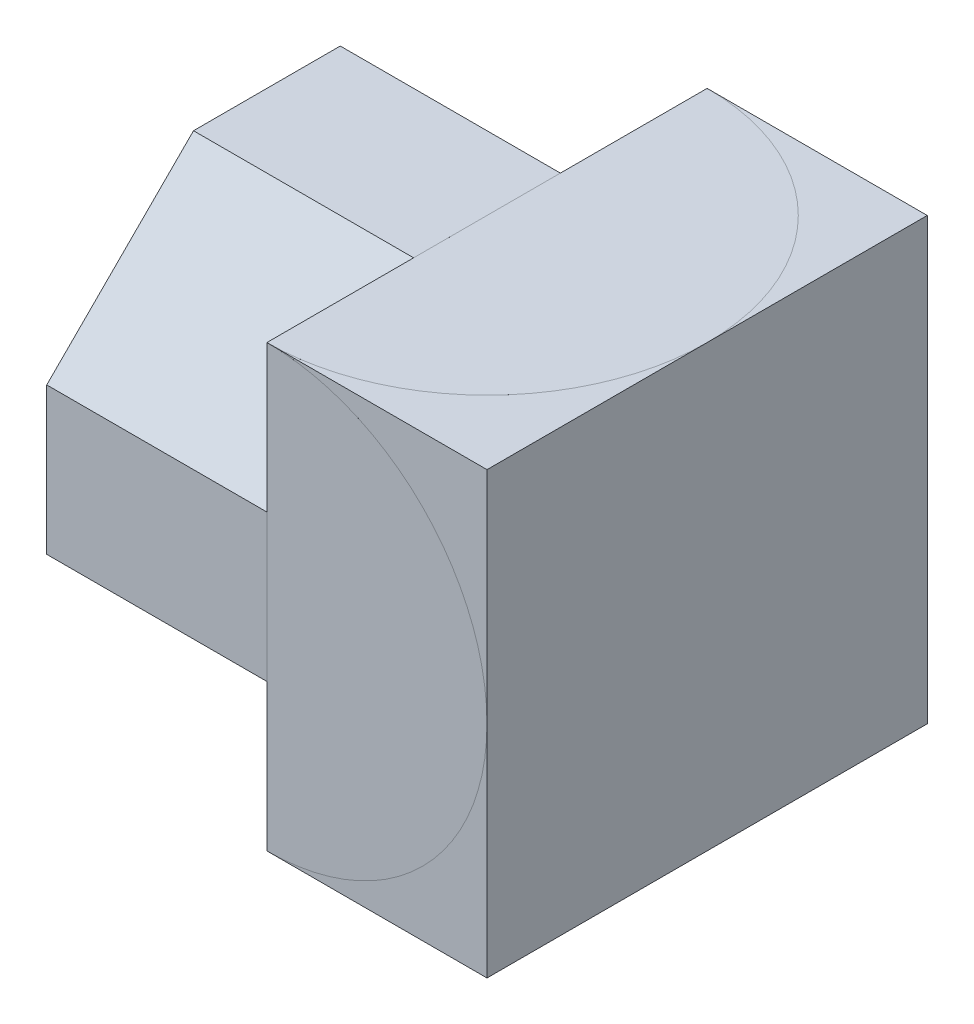
ISO-10303-21;
HEADER;
FILE_DESCRIPTION(('STEP AP214'),'2;1');
FILE_NAME('part.step','',(''),(''),'','','');
FILE_SCHEMA(('AUTOMOTIVE_DESIGN { 1 0 10303 214 1 1 1 1 }'));
ENDSEC;
DATA;
#1=APPLICATION_CONTEXT('core data for automotive mechanical design processes');
#2=APPLICATION_PROTOCOL_DEFINITION('international standard','automotive_design',2000,#1);
#3=PRODUCT_CONTEXT('',#1,'mechanical');
#4=PRODUCT('Part','Part','',(#3));
#5=PRODUCT_RELATED_PRODUCT_CATEGORY('part','',(#4));
#6=PRODUCT_DEFINITION_FORMATION('','',#4);
#7=PRODUCT_DEFINITION_CONTEXT('part definition',#1,'design');
#8=PRODUCT_DEFINITION('design','',#6,#7);
#9=PRODUCT_DEFINITION_SHAPE('','',#8);
#10=(LENGTH_UNIT() NAMED_UNIT(*) SI_UNIT(.MILLI.,.METRE.));
#11=(NAMED_UNIT(*) PLANE_ANGLE_UNIT() SI_UNIT($,.RADIAN.));
#12=(NAMED_UNIT(*) SI_UNIT($,.STERADIAN.) SOLID_ANGLE_UNIT());
#13=UNCERTAINTY_MEASURE_WITH_UNIT(LENGTH_MEASURE(1.E-05),#10,'distance_accuracy_value','');
#14=(GEOMETRIC_REPRESENTATION_CONTEXT(3) GLOBAL_UNCERTAINTY_ASSIGNED_CONTEXT((#13)) GLOBAL_UNIT_ASSIGNED_CONTEXT((#10,
#11,#12)) REPRESENTATION_CONTEXT('',''));
#15=CARTESIAN_POINT('',(0.,0.,0.));
#16=DIRECTION('',(0.,0.,1.));
#17=DIRECTION('',(1.,0.,0.));
#18=AXIS2_PLACEMENT_3D('',#15,#16,#17);
#19=CARTESIAN_POINT('',(0.,0.,60.));
#20=DIRECTION('',(0.,0.,-1.));
#21=DIRECTION('',(-1.,0.,0.));
#22=AXIS2_PLACEMENT_3D('',#19,#20,#21);
#23=PLANE('',#22);
#24=DIRECTION('',(-1.,0.,0.));
#25=VECTOR('',#24,1.);
#26=CARTESIAN_POINT('',(0.,60.,60.));
#27=LINE('',#26,#25);
#28=CARTESIAN_POINT('',(60.,60.,60.));
#29=VERTEX_POINT('',#28);
#30=CARTESIAN_POINT('',(30.,60.,60.));
#31=VERTEX_POINT('',#30);
#32=EDGE_CURVE('E237',#29,#31,#27,.T.);
#33=ORIENTED_EDGE('',*,*,#32,.T.);
#34=CARTESIAN_POINT('',(30.,30.,60.));
#35=DIRECTION('',(0.,0.,1.));
#36=DIRECTION('',(-1.,0.,0.));
#37=AXIS2_PLACEMENT_3D('',#34,#35,#36);
#38=CIRCLE('',#37,30.);
#39=CARTESIAN_POINT('',(60.,30.,59.99995));
#40=VERTEX_POINT('',#39);
#41=EDGE_CURVE('E253',#40,#31,#38,.T.);
#42=ORIENTED_EDGE('',*,*,#41,.F.);
#43=DIRECTION('',(0.,1.,0.));
#44=VECTOR('',#43,1.);
#45=CARTESIAN_POINT('',(60.,0.,60.));
#46=LINE('',#45,#44);
#47=EDGE_CURVE('E37',#40,#29,#46,.T.);
#48=ORIENTED_EDGE('',*,*,#47,.T.);
#49=EDGE_LOOP('',(#33,#42,#48));
#50=FACE_BOUND('',#49,.T.);
#51=ADVANCED_FACE('F33',(#50),#23,.F.);
#52=CARTESIAN_POINT('',(60.,0.,60.));
#53=VERTEX_POINT('',#52);
#54=EDGE_CURVE('E240',#53,#40,#46,.T.);
#55=ORIENTED_EDGE('',*,*,#54,.T.);
#56=CARTESIAN_POINT('',(30.,0.,60.));
#57=VERTEX_POINT('',#56);
#58=EDGE_CURVE('E173',#57,#40,#38,.T.);
#59=ORIENTED_EDGE('',*,*,#58,.F.);
#60=DIRECTION('',(1.,0.,0.));
#61=VECTOR('',#60,1.);
#62=CARTESIAN_POINT('',(0.,0.,60.));
#63=LINE('',#62,#61);
#64=EDGE_CURVE('E183',#57,#53,#63,.T.);
#65=ORIENTED_EDGE('',*,*,#64,.T.);
#66=EDGE_LOOP('',(#55,#59,#65));
#67=FACE_BOUND('',#66,.T.);
#68=ADVANCED_FACE('F360',(#67),#23,.F.);
#69=CARTESIAN_POINT('',(0.,60.,60.));
#70=DIRECTION('',(0.,-1.,0.));
#71=DIRECTION('',(0.,0.,-1.));
#72=AXIS2_PLACEMENT_3D('',#69,#70,#71);
#73=PLANE('',#72);
#74=DIRECTION('',(-1.,0.,0.));
#75=VECTOR('',#74,1.);
#76=CARTESIAN_POINT('',(0.,60.,0.));
#77=LINE('',#76,#75);
#78=CARTESIAN_POINT('',(60.,60.,0.));
#79=VERTEX_POINT('',#78);
#80=CARTESIAN_POINT('',(30.,60.,0.));
#81=VERTEX_POINT('',#80);
#82=EDGE_CURVE('E234',#79,#81,#77,.T.);
#83=ORIENTED_EDGE('',*,*,#82,.T.);
#84=CARTESIAN_POINT('',(30.,60.,30.));
#85=DIRECTION('',(0.,1.,0.));
#86=DIRECTION('',(0.,0.,-1.));
#87=AXIS2_PLACEMENT_3D('',#84,#85,#86);
#88=CIRCLE('',#87,30.);
#89=CARTESIAN_POINT('',(60.,59.99995,30.));
#90=VERTEX_POINT('',#89);
#91=EDGE_CURVE('E267',#90,#81,#88,.T.);
#92=ORIENTED_EDGE('',*,*,#91,.F.);
#93=DIRECTION('',(0.,0.,-1.));
#94=VECTOR('',#93,1.);
#95=CARTESIAN_POINT('',(60.,60.,60.));
#96=LINE('',#95,#94);
#97=EDGE_CURVE('E247',#90,#79,#96,.T.);
#98=ORIENTED_EDGE('',*,*,#97,.T.);
#99=EDGE_LOOP('',(#83,#92,#98));
#100=FACE_BOUND('',#99,.T.);
#101=ADVANCED_FACE('F306',(#100),#73,.F.);
#102=EDGE_CURVE('E322',#29,#90,#96,.T.);
#103=ORIENTED_EDGE('',*,*,#102,.T.);
#104=EDGE_CURVE('E264',#31,#90,#88,.T.);
#105=ORIENTED_EDGE('',*,*,#104,.F.);
#106=ORIENTED_EDGE('',*,*,#32,.F.);
#107=EDGE_LOOP('',(#103,#105,#106));
#108=FACE_BOUND('',#107,.T.);
#109=ADVANCED_FACE('F375',(#108),#73,.F.);
#110=CARTESIAN_POINT('',(0.,0.,60.));
#111=DIRECTION('',(1.,0.,0.));
#112=DIRECTION('',(0.,0.,-1.));
#113=AXIS2_PLACEMENT_3D('',#110,#111,#112);
#114=PLANE('',#113);
#115=DIRECTION('',(0.,-1.,0.));
#116=VECTOR('',#115,1.);
#117=CARTESIAN_POINT('',(0.,0.,0.));
#118=LINE('',#117,#116);
#119=CARTESIAN_POINT('',(0.,40.,0.));
#120=VERTEX_POINT('',#119);
#121=CARTESIAN_POINT('',(0.,20.,0.));
#122=VERTEX_POINT('',#121);
#123=EDGE_CURVE('E230',#120,#122,#118,.T.);
#124=ORIENTED_EDGE('',*,*,#123,.T.);
#125=DIRECTION('',(0.,0.707106781186547,-0.707106781186548));
#126=VECTOR('',#125,1.);
#127=CARTESIAN_POINT('',(0.,20.,0.));
#128=LINE('',#127,#126);
#129=CARTESIAN_POINT('',(0.,0.,20.));
#130=VERTEX_POINT('',#129);
#131=EDGE_CURVE('E279',#130,#122,#128,.T.);
#132=ORIENTED_EDGE('',*,*,#131,.F.);
#133=DIRECTION('',(0.,0.,-1.));
#134=VECTOR('',#133,1.);
#135=CARTESIAN_POINT('',(0.,0.,60.));
#136=LINE('',#135,#134);
#137=CARTESIAN_POINT('',(0.,0.,40.0000000000004));
#138=VERTEX_POINT('',#137);
#139=EDGE_CURVE('E43',#138,#130,#136,.T.);
#140=ORIENTED_EDGE('',*,*,#139,.F.);
#141=DIRECTION('',(0.,-0.707106781186554,-0.707106781186541));
#142=VECTOR('',#141,1.);
#143=CARTESIAN_POINT('',(0.,20.,60.));
#144=LINE('',#143,#142);
#145=CARTESIAN_POINT('',(0.,20.,60.));
#146=VERTEX_POINT('',#145);
#147=EDGE_CURVE('E197',#146,#138,#144,.T.);
#148=ORIENTED_EDGE('',*,*,#147,.F.);
#149=DIRECTION('',(0.,-1.,0.));
#150=VECTOR('',#149,1.);
#151=CARTESIAN_POINT('',(0.,0.,60.));
#152=LINE('',#151,#150);
#153=CARTESIAN_POINT('',(0.,40.,60.));
#154=VERTEX_POINT('',#153);
#155=EDGE_CURVE('E231',#154,#146,#152,.T.);
#156=ORIENTED_EDGE('',*,*,#155,.F.);
#157=DIRECTION('',(0.,0.707106781186548,-0.707106781186547));
#158=VECTOR('',#157,1.);
#159=CARTESIAN_POINT('',(0.,40.,60.));
#160=LINE('',#159,#158);
#161=CARTESIAN_POINT('',(0.,60.,40.));
#162=VERTEX_POINT('',#161);
#163=EDGE_CURVE('E205',#154,#162,#160,.T.);
#164=ORIENTED_EDGE('',*,*,#163,.T.);
#165=DIRECTION('',(0.,0.,-1.));
#166=VECTOR('',#165,1.);
#167=CARTESIAN_POINT('',(0.,60.,60.));
#168=LINE('',#167,#166);
#169=CARTESIAN_POINT('',(0.,60.,20.));
#170=VERTEX_POINT('',#169);
#171=EDGE_CURVE('E316',#162,#170,#168,.T.);
#172=ORIENTED_EDGE('',*,*,#171,.T.);
#173=DIRECTION('',(0.,-0.707106781186548,-0.707106781186547));
#174=VECTOR('',#173,1.);
#175=CARTESIAN_POINT('',(0.,60.,20.));
#176=LINE('',#175,#174);
#177=EDGE_CURVE('E200',#170,#120,#176,.T.);
#178=ORIENTED_EDGE('',*,*,#177,.T.);
#179=EDGE_LOOP('',(#124,#132,#140,#148,#156,#164,#172,#178));
#180=FACE_BOUND('',#179,.T.);
#181=ADVANCED_FACE('F35',(#180),#114,.F.);
#182=CARTESIAN_POINT('',(0.,0.,60.));
#183=DIRECTION('',(0.,1.,0.));
#184=DIRECTION('',(0.,0.,1.));
#185=AXIS2_PLACEMENT_3D('',#182,#183,#184);
#186=PLANE('',#185);
#187=ORIENTED_EDGE('',*,*,#139,.T.);
#188=DIRECTION('',(-1.,0.,0.));
#189=VECTOR('',#188,1.);
#190=CARTESIAN_POINT('',(30.,0.,20.));
#191=LINE('',#190,#189);
#192=CARTESIAN_POINT('',(30.,0.,20.));
#193=VERTEX_POINT('',#192);
#194=EDGE_CURVE('E593',#193,#130,#191,.T.);
#195=ORIENTED_EDGE('',*,*,#194,.F.);
#196=DIRECTION('',(0.,0.,1.));
#197=VECTOR('',#196,1.);
#198=CARTESIAN_POINT('',(30.,0.,20.));
#199=LINE('',#198,#197);
#200=CARTESIAN_POINT('',(30.,0.,0.));
#201=VERTEX_POINT('',#200);
#202=EDGE_CURVE('E595',#201,#193,#199,.T.);
#203=ORIENTED_EDGE('',*,*,#202,.F.);
#204=DIRECTION('',(1.,0.,0.));
#205=VECTOR('',#204,1.);
#206=CARTESIAN_POINT('',(0.,0.,0.));
#207=LINE('',#206,#205);
#208=CARTESIAN_POINT('',(60.,0.,0.));
#209=VERTEX_POINT('',#208);
#210=EDGE_CURVE('E312',#201,#209,#207,.T.);
#211=ORIENTED_EDGE('',*,*,#210,.T.);
#212=DIRECTION('',(0.,0.,-1.));
#213=VECTOR('',#212,1.);
#214=CARTESIAN_POINT('',(60.,0.,60.));
#215=LINE('',#214,#213);
#216=EDGE_CURVE('E319',#53,#209,#215,.T.);
#217=ORIENTED_EDGE('',*,*,#216,.F.);
#218=ORIENTED_EDGE('',*,*,#64,.F.);
#219=DIRECTION('',(0.,0.,1.));
#220=VECTOR('',#219,1.);
#221=CARTESIAN_POINT('',(30.,0.,59.9999));
#222=LINE('',#221,#220);
#223=CARTESIAN_POINT('',(30.,0.,59.9999));
#224=VERTEX_POINT('',#223);
#225=EDGE_CURVE('E171',#224,#57,#222,.T.);
#226=ORIENTED_EDGE('',*,*,#225,.F.);
#227=DIRECTION('',(0.,0.,1.));
#228=VECTOR('',#227,1.);
#229=CARTESIAN_POINT('',(30.,0.,40.0000000000004));
#230=LINE('',#229,#228);
#231=CARTESIAN_POINT('',(30.,0.,40.0000000000004));
#232=VERTEX_POINT('',#231);
#233=EDGE_CURVE('E181',#232,#224,#230,.T.);
#234=ORIENTED_EDGE('',*,*,#233,.F.);
#235=DIRECTION('',(-1.,0.,0.));
#236=VECTOR('',#235,1.);
#237=CARTESIAN_POINT('',(30.,0.,40.0000000000004));
#238=LINE('',#237,#236);
#239=EDGE_CURVE('E192',#232,#138,#238,.T.);
#240=ORIENTED_EDGE('',*,*,#239,.T.);
#241=EDGE_LOOP('',(#187,#195,#203,#211,#217,#218,#226,#234,#240));
#242=FACE_BOUND('',#241,.T.);
#243=ADVANCED_FACE('F179',(#242),#186,.F.);
#244=CARTESIAN_POINT('',(60.,0.,60.));
#245=DIRECTION('',(-1.,0.,0.));
#246=DIRECTION('',(0.,0.,1.));
#247=AXIS2_PLACEMENT_3D('',#244,#245,#246);
#248=PLANE('',#247);
#249=ORIENTED_EDGE('',*,*,#47,.F.);
#250=ORIENTED_EDGE('',*,*,#54,.F.);
#251=ORIENTED_EDGE('',*,*,#216,.T.);
#252=DIRECTION('',(0.,1.,0.));
#253=VECTOR('',#252,1.);
#254=CARTESIAN_POINT('',(60.,0.,0.));
#255=LINE('',#254,#253);
#256=EDGE_CURVE('E310',#209,#79,#255,.T.);
#257=ORIENTED_EDGE('',*,*,#256,.T.);
#258=ORIENTED_EDGE('',*,*,#97,.F.);
#259=ORIENTED_EDGE('',*,*,#102,.F.);
#260=EDGE_LOOP('',(#249,#250,#251,#257,#258,#259));
#261=FACE_BOUND('',#260,.T.);
#262=ADVANCED_FACE('F329',(#261),#248,.F.);
#263=DIRECTION('',(-1.,0.,0.));
#264=VECTOR('',#263,1.);
#265=CARTESIAN_POINT('',(0.,60.,40.));
#266=LINE('',#265,#264);
#267=CARTESIAN_POINT('',(30.,60.,40.));
#268=VERTEX_POINT('',#267);
#269=EDGE_CURVE('E212',#268,#162,#266,.T.);
#270=ORIENTED_EDGE('',*,*,#269,.F.);
#271=DIRECTION('',(0.,0.,1.));
#272=VECTOR('',#271,1.);
#273=CARTESIAN_POINT('',(30.,60.,60.));
#274=LINE('',#273,#272);
#275=CARTESIAN_POINT('',(30.,60.,20.));
#276=VERTEX_POINT('',#275);
#277=EDGE_CURVE('E261',#276,#268,#274,.T.);
#278=ORIENTED_EDGE('',*,*,#277,.F.);
#279=DIRECTION('',(1.,0.,0.));
#280=VECTOR('',#279,1.);
#281=CARTESIAN_POINT('',(0.,60.,20.));
#282=LINE('',#281,#280);
#283=EDGE_CURVE('E219',#170,#276,#282,.T.);
#284=ORIENTED_EDGE('',*,*,#283,.F.);
#285=ORIENTED_EDGE('',*,*,#171,.F.);
#286=EDGE_LOOP('',(#270,#278,#284,#285));
#287=FACE_BOUND('',#286,.T.);
#288=ADVANCED_FACE('F368',(#287),#73,.F.);
#289=DIRECTION('',(-1.,0.,0.));
#290=VECTOR('',#289,1.);
#291=CARTESIAN_POINT('',(30.,20.,60.));
#292=LINE('',#291,#290);
#293=CARTESIAN_POINT('',(30.,20.,60.));
#294=VERTEX_POINT('',#293);
#295=EDGE_CURVE('E189',#294,#146,#292,.T.);
#296=ORIENTED_EDGE('',*,*,#295,.F.);
#297=DIRECTION('',(0.,-1.,0.));
#298=VECTOR('',#297,1.);
#299=CARTESIAN_POINT('',(30.,0.,60.));
#300=LINE('',#299,#298);
#301=CARTESIAN_POINT('',(30.,40.,60.));
#302=VERTEX_POINT('',#301);
#303=EDGE_CURVE('E293',#302,#294,#300,.T.);
#304=ORIENTED_EDGE('',*,*,#303,.F.);
#305=DIRECTION('',(1.,0.,0.));
#306=VECTOR('',#305,1.);
#307=CARTESIAN_POINT('',(0.,40.,60.));
#308=LINE('',#307,#306);
#309=EDGE_CURVE('E216',#154,#302,#308,.T.);
#310=ORIENTED_EDGE('',*,*,#309,.F.);
#311=ORIENTED_EDGE('',*,*,#155,.T.);
#312=EDGE_LOOP('',(#296,#304,#310,#311));
#313=FACE_BOUND('',#312,.T.);
#314=ADVANCED_FACE('F356',(#313),#23,.F.);
#315=CARTESIAN_POINT('',(0.,0.,0.));
#316=DIRECTION('',(0.,0.,-1.));
#317=DIRECTION('',(-1.,0.,0.));
#318=AXIS2_PLACEMENT_3D('',#315,#316,#317);
#319=PLANE('',#318);
#320=DIRECTION('',(-1.,0.,0.));
#321=VECTOR('',#320,1.);
#322=CARTESIAN_POINT('',(30.,20.,0.));
#323=LINE('',#322,#321);
#324=CARTESIAN_POINT('',(30.,20.,0.));
#325=VERTEX_POINT('',#324);
#326=EDGE_CURVE('E199',#325,#122,#323,.T.);
#327=ORIENTED_EDGE('',*,*,#326,.T.);
#328=ORIENTED_EDGE('',*,*,#123,.F.);
#329=DIRECTION('',(-1.,0.,0.));
#330=VECTOR('',#329,1.);
#331=CARTESIAN_POINT('',(0.,40.,0.));
#332=LINE('',#331,#330);
#333=CARTESIAN_POINT('',(30.,40.,0.));
#334=VERTEX_POINT('',#333);
#335=EDGE_CURVE('E222',#334,#120,#332,.T.);
#336=ORIENTED_EDGE('',*,*,#335,.F.);
#337=DIRECTION('',(0.,1.,0.));
#338=VECTOR('',#337,1.);
#339=CARTESIAN_POINT('',(30.,40.,0.));
#340=LINE('',#339,#338);
#341=CARTESIAN_POINT('',(30.,59.9999,0.));
#342=VERTEX_POINT('',#341);
#343=EDGE_CURVE('E225',#334,#342,#340,.T.);
#344=ORIENTED_EDGE('',*,*,#343,.T.);
#345=DIRECTION('',(0.,1.,0.));
#346=VECTOR('',#345,1.);
#347=CARTESIAN_POINT('',(30.,59.9999,0.));
#348=LINE('',#347,#346);
#349=EDGE_CURVE('E272',#342,#81,#348,.T.);
#350=ORIENTED_EDGE('',*,*,#349,.T.);
#351=ORIENTED_EDGE('',*,*,#82,.F.);
#352=ORIENTED_EDGE('',*,*,#256,.F.);
#353=ORIENTED_EDGE('',*,*,#210,.F.);
#354=DIRECTION('',(0.,-1.,0.));
#355=VECTOR('',#354,1.);
#356=CARTESIAN_POINT('',(30.,0.,0.));
#357=LINE('',#356,#355);
#358=EDGE_CURVE('E334',#325,#201,#357,.T.);
#359=ORIENTED_EDGE('',*,*,#358,.F.);
#360=EDGE_LOOP('',(#327,#328,#336,#344,#350,#351,#352,#353,#359));
#361=FACE_BOUND('',#360,.T.);
#362=ADVANCED_FACE('F332',(#361),#319,.T.);
#363=CARTESIAN_POINT('',(30.,40.,0.));
#364=DIRECTION('',(1.,0.,0.));
#365=DIRECTION('',(0.,0.,-1.));
#366=AXIS2_PLACEMENT_3D('',#363,#364,#365);
#367=PLANE('',#366);
#368=DIRECTION('',(0.,-0.707106781186548,-0.707106781186547));
#369=VECTOR('',#368,1.);
#370=CARTESIAN_POINT('',(30.,60.,20.));
#371=LINE('',#370,#369);
#372=CARTESIAN_POINT('',(30.,59.9999,19.9999));
#373=VERTEX_POINT('',#372);
#374=EDGE_CURVE('E206',#373,#334,#371,.T.);
#375=ORIENTED_EDGE('',*,*,#374,.F.);
#376=DIRECTION('',(0.,0.,1.));
#377=VECTOR('',#376,1.);
#378=CARTESIAN_POINT('',(30.,59.9999,60.));
#379=LINE('',#378,#377);
#380=EDGE_CURVE('E59',#342,#373,#379,.T.);
#381=ORIENTED_EDGE('',*,*,#380,.F.);
#382=ORIENTED_EDGE('',*,*,#343,.F.);
#383=EDGE_LOOP('',(#375,#381,#382));
#384=FACE_BOUND('',#383,.T.);
#385=ADVANCED_FACE('F347',(#384),#367,.F.);
#386=CARTESIAN_POINT('',(30.,40.,60.));
#387=DIRECTION('',(1.,0.,0.));
#388=DIRECTION('',(0.,0.,-1.));
#389=AXIS2_PLACEMENT_3D('',#386,#387,#388);
#390=PLANE('',#389);
#391=DIRECTION('',(0.,0.707106781186548,-0.707106781186547));
#392=VECTOR('',#391,1.);
#393=CARTESIAN_POINT('',(30.,40.,60.));
#394=LINE('',#393,#392);
#395=CARTESIAN_POINT('',(30.,40.0001,59.9999));
#396=VERTEX_POINT('',#395);
#397=CARTESIAN_POINT('',(30.,59.9999,40.0001));
#398=VERTEX_POINT('',#397);
#399=EDGE_CURVE('E213',#396,#398,#394,.T.);
#400=ORIENTED_EDGE('',*,*,#399,.F.);
#401=DIRECTION('',(0.,-1.,0.));
#402=VECTOR('',#401,1.);
#403=CARTESIAN_POINT('',(30.,0.,59.9999));
#404=LINE('',#403,#402);
#405=CARTESIAN_POINT('',(30.,59.9999,59.9999));
#406=VERTEX_POINT('',#405);
#407=EDGE_CURVE('E167',#406,#396,#404,.T.);
#408=ORIENTED_EDGE('',*,*,#407,.F.);
#409=EDGE_CURVE('E245',#398,#406,#379,.T.);
#410=ORIENTED_EDGE('',*,*,#409,.F.);
#411=EDGE_LOOP('',(#400,#408,#410));
#412=FACE_BOUND('',#411,.T.);
#413=ADVANCED_FACE('F288',(#412),#390,.F.);
#414=CARTESIAN_POINT('',(30.,40.,60.));
#415=DIRECTION('',(0.,0.707106781186547,0.707106781186548));
#416=DIRECTION('',(0.,-0.707106781186548,0.707106781186547));
#417=AXIS2_PLACEMENT_3D('',#414,#415,#416);
#418=PLANE('',#417);
#419=ORIENTED_EDGE('',*,*,#163,.F.);
#420=ORIENTED_EDGE('',*,*,#309,.T.);
#421=EDGE_CURVE('E209',#302,#396,#394,.T.);
#422=ORIENTED_EDGE('',*,*,#421,.T.);
#423=ORIENTED_EDGE('',*,*,#399,.T.);
#424=DIRECTION('',(0.,-0.707106781186548,0.707106781186547));
#425=VECTOR('',#424,1.);
#426=CARTESIAN_POINT('',(30.,40.,60.));
#427=LINE('',#426,#425);
#428=EDGE_CURVE('E262',#268,#398,#427,.T.);
#429=ORIENTED_EDGE('',*,*,#428,.F.);
#430=ORIENTED_EDGE('',*,*,#269,.T.);
#431=EDGE_LOOP('',(#419,#420,#422,#423,#429,#430));
#432=FACE_BOUND('',#431,.T.);
#433=ADVANCED_FACE('F354',(#432),#418,.T.);
#434=CARTESIAN_POINT('',(30.,60.,20.));
#435=DIRECTION('',(0.,0.707106781186547,-0.707106781186548));
#436=DIRECTION('',(0.,0.707106781186548,0.707106781186547));
#437=AXIS2_PLACEMENT_3D('',#434,#435,#436);
#438=PLANE('',#437);
#439=ORIENTED_EDGE('',*,*,#177,.F.);
#440=ORIENTED_EDGE('',*,*,#283,.T.);
#441=EDGE_CURVE('E202',#276,#373,#371,.T.);
#442=ORIENTED_EDGE('',*,*,#441,.T.);
#443=ORIENTED_EDGE('',*,*,#374,.T.);
#444=ORIENTED_EDGE('',*,*,#335,.T.);
#445=EDGE_LOOP('',(#439,#440,#442,#443,#444));
#446=FACE_BOUND('',#445,.T.);
#447=ADVANCED_FACE('F343',(#446),#438,.T.);
#448=CARTESIAN_POINT('',(30.,20.,60.));
#449=DIRECTION('',(0.,0.707106781186541,-0.707106781186554));
#450=DIRECTION('',(0.,0.707106781186554,0.707106781186541));
#451=AXIS2_PLACEMENT_3D('',#448,#449,#450);
#452=PLANE('',#451);
#453=ORIENTED_EDGE('',*,*,#147,.T.);
#454=ORIENTED_EDGE('',*,*,#239,.F.);
#455=DIRECTION('',(0.,-0.707106781186554,-0.707106781186541));
#456=VECTOR('',#455,1.);
#457=CARTESIAN_POINT('',(30.,20.,60.));
#458=LINE('',#457,#456);
#459=CARTESIAN_POINT('',(30.,19.9999,59.9999));
#460=VERTEX_POINT('',#459);
#461=EDGE_CURVE('E187',#460,#232,#458,.T.);
#462=ORIENTED_EDGE('',*,*,#461,.F.);
#463=EDGE_CURVE('E190',#294,#460,#458,.T.);
#464=ORIENTED_EDGE('',*,*,#463,.F.);
#465=ORIENTED_EDGE('',*,*,#295,.T.);
#466=EDGE_LOOP('',(#453,#454,#462,#464,#465));
#467=FACE_BOUND('',#466,.T.);
#468=ADVANCED_FACE('F382',(#467),#452,.F.);
#469=CARTESIAN_POINT('',(30.,0.,0.));
#470=DIRECTION('',(1.,0.,0.));
#471=DIRECTION('',(0.,0.,-1.));
#472=AXIS2_PLACEMENT_3D('',#469,#470,#471);
#473=PLANE('',#472);
#474=ORIENTED_EDGE('',*,*,#233,.T.);
#475=EDGE_CURVE('E156',#460,#224,#404,.T.);
#476=ORIENTED_EDGE('',*,*,#475,.F.);
#477=ORIENTED_EDGE('',*,*,#461,.T.);
#478=EDGE_LOOP('',(#474,#476,#477));
#479=FACE_BOUND('',#478,.T.);
#480=ADVANCED_FACE('F186',(#479),#473,.F.);
#481=CARTESIAN_POINT('',(30.,20.,0.));
#482=DIRECTION('',(0.,0.707106781186548,0.707106781186547));
#483=DIRECTION('',(0.,-0.707106781186547,0.707106781186548));
#484=AXIS2_PLACEMENT_3D('',#481,#482,#483);
#485=PLANE('',#484);
#486=ORIENTED_EDGE('',*,*,#131,.T.);
#487=ORIENTED_EDGE('',*,*,#326,.F.);
#488=DIRECTION('',(0.,0.707106781186547,-0.707106781186548));
#489=VECTOR('',#488,1.);
#490=CARTESIAN_POINT('',(30.,20.,0.));
#491=LINE('',#490,#489);
#492=EDGE_CURVE('E598',#193,#325,#491,.T.);
#493=ORIENTED_EDGE('',*,*,#492,.F.);
#494=ORIENTED_EDGE('',*,*,#194,.T.);
#495=EDGE_LOOP('',(#486,#487,#493,#494));
#496=FACE_BOUND('',#495,.T.);
#497=ADVANCED_FACE('F405',(#496),#485,.F.);
#498=CARTESIAN_POINT('',(30.,0.,0.));
#499=DIRECTION('',(-1.,0.,0.));
#500=DIRECTION('',(0.,0.,1.));
#501=AXIS2_PLACEMENT_3D('',#498,#499,#500);
#502=PLANE('',#501);
#503=ORIENTED_EDGE('',*,*,#358,.T.);
#504=ORIENTED_EDGE('',*,*,#202,.T.);
#505=ORIENTED_EDGE('',*,*,#492,.T.);
#506=EDGE_LOOP('',(#503,#504,#505));
#507=FACE_BOUND('',#506,.T.);
#508=ADVANCED_FACE('F402',(#507),#502,.T.);
#509=CARTESIAN_POINT('',(30.,59.9999,30.));
#510=DIRECTION('',(0.,1.,0.));
#511=DIRECTION('',(0.,0.,1.));
#512=AXIS2_PLACEMENT_3D('',#509,#510,#511);
#513=CYLINDRICAL_SURFACE('',#512,30.);
#514=CARTESIAN_POINT('',(30.,59.9999,30.));
#515=DIRECTION('',(0.,1.,0.));
#516=DIRECTION('',(0.,0.,-1.));
#517=AXIS2_PLACEMENT_3D('',#514,#515,#516);
#518=CIRCLE('',#517,30.);
#519=CARTESIAN_POINT('',(30.0774596023755,59.9999,59.9999));
#520=VERTEX_POINT('',#519);
#521=EDGE_CURVE('E242',#520,#90,#518,.T.);
#522=ORIENTED_EDGE('',*,*,#521,.F.);
#523=CARTESIAN_POINT('',(30.,30.,30.));
#524=DIRECTION('',(0.,0.707106781186547,-0.707106781186547));
#525=DIRECTION('',(0.,0.707106781186547,0.707106781186547));
#526=AXIS2_PLACEMENT_3D('',#523,#524,#525);
#527=ELLIPSE('',#526,42.4264068711928,30.);
#528=EDGE_CURVE('E184',#520,#31,#527,.F.);
#529=ORIENTED_EDGE('',*,*,#528,.T.);
#530=ORIENTED_EDGE('',*,*,#104,.T.);
#531=EDGE_LOOP('',(#522,#529,#530));
#532=FACE_BOUND('',#531,.T.);
#533=ADVANCED_FACE('F398',(#532),#513,.F.);
#534=ORIENTED_EDGE('',*,*,#91,.T.);
#535=ORIENTED_EDGE('',*,*,#349,.F.);
#536=EDGE_CURVE('E246',#90,#342,#518,.T.);
#537=ORIENTED_EDGE('',*,*,#536,.F.);
#538=EDGE_LOOP('',(#534,#535,#537));
#539=FACE_BOUND('',#538,.T.);
#540=ADVANCED_FACE('F303',(#539),#513,.F.);
#541=CARTESIAN_POINT('',(30.,59.9999,60.));
#542=DIRECTION('',(-1.,0.,0.));
#543=DIRECTION('',(0.,0.,1.));
#544=AXIS2_PLACEMENT_3D('',#541,#542,#543);
#545=PLANE('',#544);
#546=ORIENTED_EDGE('',*,*,#428,.T.);
#547=EDGE_CURVE('E280',#373,#398,#379,.T.);
#548=ORIENTED_EDGE('',*,*,#547,.F.);
#549=ORIENTED_EDGE('',*,*,#441,.F.);
#550=ORIENTED_EDGE('',*,*,#277,.T.);
#551=EDGE_LOOP('',(#546,#548,#549,#550));
#552=FACE_BOUND('',#551,.T.);
#553=ADVANCED_FACE('F390',(#552),#545,.F.);
#554=CARTESIAN_POINT('',(30.,59.9999,30.));
#555=DIRECTION('',(0.,-1.,0.));
#556=DIRECTION('',(0.,0.,-1.));
#557=AXIS2_PLACEMENT_3D('',#554,#555,#556);
#558=PLANE('',#557);
#559=ORIENTED_EDGE('',*,*,#409,.T.);
#560=DIRECTION('',(1.,0.,0.));
#561=VECTOR('',#560,1.);
#562=CARTESIAN_POINT('',(30.,59.9999,59.9999));
#563=LINE('',#562,#561);
#564=EDGE_CURVE('E11',#406,#520,#563,.T.);
#565=ORIENTED_EDGE('',*,*,#564,.T.);
#566=ORIENTED_EDGE('',*,*,#521,.T.);
#567=ORIENTED_EDGE('',*,*,#536,.T.);
#568=ORIENTED_EDGE('',*,*,#380,.T.);
#569=ORIENTED_EDGE('',*,*,#547,.T.);
#570=EDGE_LOOP('',(#559,#565,#566,#567,#568,#569));
#571=FACE_BOUND('',#570,.T.);
#572=ADVANCED_FACE('F283',(#571),#558,.F.);
#573=CARTESIAN_POINT('',(30.,30.,59.9999));
#574=DIRECTION('',(0.,0.,1.));
#575=DIRECTION('',(1.,0.,0.));
#576=AXIS2_PLACEMENT_3D('',#573,#574,#575);
#577=CYLINDRICAL_SURFACE('',#576,30.);
#578=CARTESIAN_POINT('',(30.,30.,59.9999));
#579=DIRECTION('',(0.,0.,1.));
#580=DIRECTION('',(-1.,0.,0.));
#581=AXIS2_PLACEMENT_3D('',#578,#579,#580);
#582=CIRCLE('',#581,30.);
#583=EDGE_CURVE('E160',#224,#40,#582,.T.);
#584=ORIENTED_EDGE('',*,*,#583,.F.);
#585=ORIENTED_EDGE('',*,*,#225,.T.);
#586=ORIENTED_EDGE('',*,*,#58,.T.);
#587=EDGE_LOOP('',(#584,#585,#586));
#588=FACE_BOUND('',#587,.T.);
#589=ADVANCED_FACE('F170',(#588),#577,.F.);
#590=ORIENTED_EDGE('',*,*,#41,.T.);
#591=ORIENTED_EDGE('',*,*,#528,.F.);
#592=EDGE_CURVE('E51',#40,#520,#582,.T.);
#593=ORIENTED_EDGE('',*,*,#592,.F.);
#594=EDGE_LOOP('',(#590,#591,#593));
#595=FACE_BOUND('',#594,.T.);
#596=ADVANCED_FACE('F556',(#595),#577,.F.);
#597=CARTESIAN_POINT('',(30.,0.,59.9999));
#598=DIRECTION('',(-1.,0.,0.));
#599=DIRECTION('',(0.,-1.,0.));
#600=AXIS2_PLACEMENT_3D('',#597,#598,#599);
#601=PLANE('',#600);
#602=ORIENTED_EDGE('',*,*,#421,.F.);
#603=ORIENTED_EDGE('',*,*,#303,.T.);
#604=ORIENTED_EDGE('',*,*,#463,.T.);
#605=EDGE_CURVE('E162',#396,#460,#404,.T.);
#606=ORIENTED_EDGE('',*,*,#605,.F.);
#607=EDGE_LOOP('',(#602,#603,#604,#606));
#608=FACE_BOUND('',#607,.T.);
#609=ADVANCED_FACE('F558',(#608),#601,.F.);
#610=CARTESIAN_POINT('',(30.,30.,59.9999));
#611=DIRECTION('',(0.,0.,-1.));
#612=DIRECTION('',(-1.,0.,0.));
#613=AXIS2_PLACEMENT_3D('',#610,#611,#612);
#614=PLANE('',#613);
#615=ORIENTED_EDGE('',*,*,#407,.T.);
#616=ORIENTED_EDGE('',*,*,#605,.T.);
#617=ORIENTED_EDGE('',*,*,#475,.T.);
#618=ORIENTED_EDGE('',*,*,#583,.T.);
#619=ORIENTED_EDGE('',*,*,#592,.T.);
#620=ORIENTED_EDGE('',*,*,#564,.F.);
#621=EDGE_LOOP('',(#615,#616,#617,#618,#619,#620));
#622=FACE_BOUND('',#621,.T.);
#623=ADVANCED_FACE('F159',(#622),#614,.F.);
#624=CLOSED_SHELL('',(#51,#68,#101,#109,#181,#243,#262,#288,#314,#362,#385,#413,#433,#447,#468,
#480,#497,#508,#533,#540,#553,#572,#589,#596,#609,#623));
#625=MANIFOLD_SOLID_BREP('B2',#624);
#626=ADVANCED_BREP_SHAPE_REPRESENTATION('',(#18,#625),#14);
#627=SHAPE_DEFINITION_REPRESENTATION(#9,#626);
ENDSEC;
END-ISO-10303-21;
